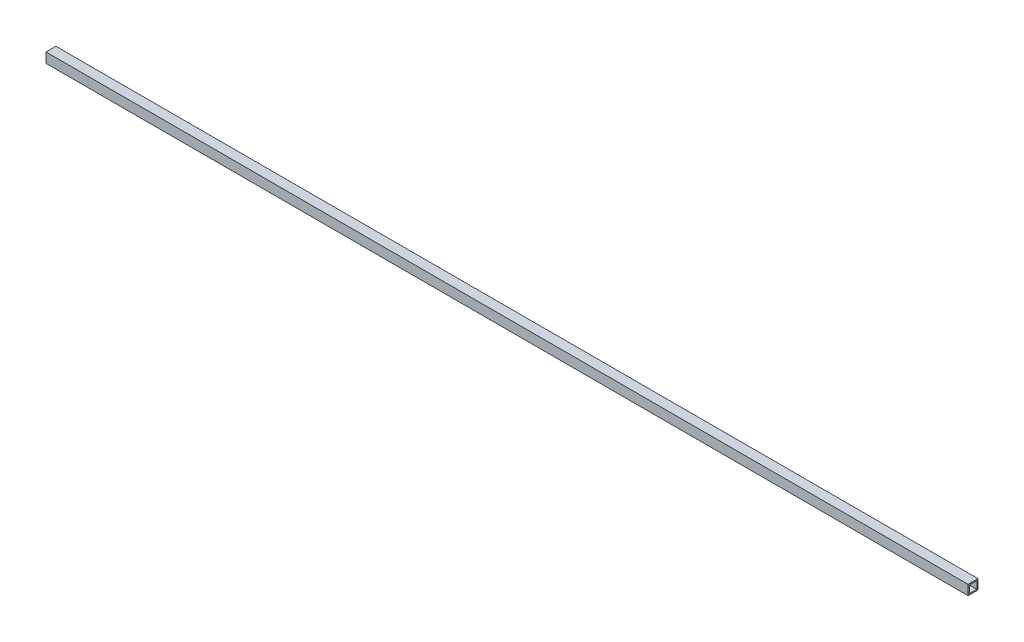
ISO-10303-21;
HEADER;
FILE_DESCRIPTION(('STEP AP214'),'2;1');
FILE_NAME('part.step','',(''),(''),'','','');
FILE_SCHEMA(('AUTOMOTIVE_DESIGN { 1 0 10303 214 1 1 1 1 }'));
ENDSEC;
DATA;
#1=APPLICATION_CONTEXT('core data for automotive mechanical design processes');
#2=APPLICATION_PROTOCOL_DEFINITION('international standard','automotive_design',2000,#1);
#3=PRODUCT_CONTEXT('',#1,'mechanical');
#4=PRODUCT('Part','Part','',(#3));
#5=PRODUCT_RELATED_PRODUCT_CATEGORY('part','',(#4));
#6=PRODUCT_DEFINITION_FORMATION('','',#4);
#7=PRODUCT_DEFINITION_CONTEXT('part definition',#1,'design');
#8=PRODUCT_DEFINITION('design','',#6,#7);
#9=PRODUCT_DEFINITION_SHAPE('','',#8);
#10=(LENGTH_UNIT() NAMED_UNIT(*) SI_UNIT(.MILLI.,.METRE.));
#11=(NAMED_UNIT(*) PLANE_ANGLE_UNIT() SI_UNIT($,.RADIAN.));
#12=(NAMED_UNIT(*) SI_UNIT($,.STERADIAN.) SOLID_ANGLE_UNIT());
#13=UNCERTAINTY_MEASURE_WITH_UNIT(LENGTH_MEASURE(1.E-05),#10,'distance_accuracy_value','');
#14=(GEOMETRIC_REPRESENTATION_CONTEXT(3) GLOBAL_UNCERTAINTY_ASSIGNED_CONTEXT((#13)) GLOBAL_UNIT_ASSIGNED_CONTEXT((#10,
#11,#12)) REPRESENTATION_CONTEXT('',''));
#15=CARTESIAN_POINT('',(0.,0.,0.));
#16=DIRECTION('',(0.,0.,1.));
#17=DIRECTION('',(1.,0.,0.));
#18=AXIS2_PLACEMENT_3D('',#15,#16,#17);
#19=CARTESIAN_POINT('',(4808.30704896854,25.4,-25.4));
#20=DIRECTION('',(0.,-1.,0.));
#21=DIRECTION('',(0.,0.,-1.));
#22=AXIS2_PLACEMENT_3D('',#19,#20,#21);
#23=PLANE('',#22);
#24=DIRECTION('',(0.,0.,1.));
#25=VECTOR('',#24,1.);
#26=CARTESIAN_POINT('',(4736.46499999999,25.4,-25.4));
#27=LINE('',#26,#25);
#28=CARTESIAN_POINT('',(4736.46499999999,25.4,-25.4));
#29=VERTEX_POINT('',#28);
#30=CARTESIAN_POINT('',(4736.46499999999,25.4,25.4));
#31=VERTEX_POINT('',#30);
#32=EDGE_CURVE('E164',#29,#31,#27,.T.);
#33=ORIENTED_EDGE('',*,*,#32,.F.);
#34=DIRECTION('',(-1.,0.,0.));
#35=VECTOR('',#34,1.);
#36=CARTESIAN_POINT('',(4808.30704896854,25.4,-25.4));
#37=LINE('',#36,#35);
#38=CARTESIAN_POINT('',(0.,25.4,-25.4));
#39=VERTEX_POINT('',#38);
#40=EDGE_CURVE('E55',#29,#39,#37,.T.);
#41=ORIENTED_EDGE('',*,*,#40,.T.);
#42=DIRECTION('',(0.,0.,1.));
#43=VECTOR('',#42,1.);
#44=CARTESIAN_POINT('',(0.,25.4,-25.4));
#45=LINE('',#44,#43);
#46=CARTESIAN_POINT('',(0.,25.4,25.4));
#47=VERTEX_POINT('',#46);
#48=EDGE_CURVE('E138',#39,#47,#45,.T.);
#49=ORIENTED_EDGE('',*,*,#48,.T.);
#50=DIRECTION('',(-1.,0.,0.));
#51=VECTOR('',#50,1.);
#52=CARTESIAN_POINT('',(4808.30704896854,25.4,25.4));
#53=LINE('',#52,#51);
#54=EDGE_CURVE('E141',#31,#47,#53,.T.);
#55=ORIENTED_EDGE('',*,*,#54,.F.);
#56=EDGE_LOOP('',(#33,#41,#49,#55));
#57=FACE_BOUND('',#56,.T.);
#58=ADVANCED_FACE('F40',(#57),#23,.F.);
#59=CARTESIAN_POINT('',(4808.30704896854,25.4,-25.4));
#60=DIRECTION('',(0.,0.,1.));
#61=DIRECTION('',(0.,-1.,0.));
#62=AXIS2_PLACEMENT_3D('',#59,#60,#61);
#63=PLANE('',#62);
#64=DIRECTION('',(0.,1.,0.));
#65=VECTOR('',#64,1.);
#66=CARTESIAN_POINT('',(4736.46499999999,25.4,-25.4));
#67=LINE('',#66,#65);
#68=CARTESIAN_POINT('',(4736.46499999999,-25.4,-25.4));
#69=VERTEX_POINT('',#68);
#70=EDGE_CURVE('E167',#69,#29,#67,.T.);
#71=ORIENTED_EDGE('',*,*,#70,.F.);
#72=DIRECTION('',(-1.,0.,0.));
#73=VECTOR('',#72,1.);
#74=CARTESIAN_POINT('',(4808.30704896854,-25.4,-25.4));
#75=LINE('',#74,#73);
#76=CARTESIAN_POINT('',(0.,-25.4,-25.4));
#77=VERTEX_POINT('',#76);
#78=EDGE_CURVE('E144',#69,#77,#75,.T.);
#79=ORIENTED_EDGE('',*,*,#78,.T.);
#80=DIRECTION('',(0.,1.,0.));
#81=VECTOR('',#80,1.);
#82=CARTESIAN_POINT('',(0.,25.4,-25.4));
#83=LINE('',#82,#81);
#84=EDGE_CURVE('E136',#77,#39,#83,.T.);
#85=ORIENTED_EDGE('',*,*,#84,.T.);
#86=ORIENTED_EDGE('',*,*,#40,.F.);
#87=EDGE_LOOP('',(#71,#79,#85,#86));
#88=FACE_BOUND('',#87,.T.);
#89=ADVANCED_FACE('F166',(#88),#63,.F.);
#90=CARTESIAN_POINT('',(4808.30704896854,-25.4,-25.4));
#91=DIRECTION('',(0.,1.,0.));
#92=DIRECTION('',(0.,0.,1.));
#93=AXIS2_PLACEMENT_3D('',#90,#91,#92);
#94=PLANE('',#93);
#95=DIRECTION('',(0.,0.,-1.));
#96=VECTOR('',#95,1.);
#97=CARTESIAN_POINT('',(4736.46499999999,-25.4,-25.4));
#98=LINE('',#97,#96);
#99=CARTESIAN_POINT('',(4736.46499999999,-25.4,25.4));
#100=VERTEX_POINT('',#99);
#101=EDGE_CURVE('E152',#100,#69,#98,.T.);
#102=ORIENTED_EDGE('',*,*,#101,.F.);
#103=DIRECTION('',(-1.,0.,0.));
#104=VECTOR('',#103,1.);
#105=CARTESIAN_POINT('',(4808.30704896854,-25.4,25.4));
#106=LINE('',#105,#104);
#107=CARTESIAN_POINT('',(0.,-25.4,25.4));
#108=VERTEX_POINT('',#107);
#109=EDGE_CURVE('E48',#100,#108,#106,.T.);
#110=ORIENTED_EDGE('',*,*,#109,.T.);
#111=DIRECTION('',(0.,0.,-1.));
#112=VECTOR('',#111,1.);
#113=CARTESIAN_POINT('',(0.,-25.4,-25.4));
#114=LINE('',#113,#112);
#115=EDGE_CURVE('E133',#108,#77,#114,.T.);
#116=ORIENTED_EDGE('',*,*,#115,.T.);
#117=ORIENTED_EDGE('',*,*,#78,.F.);
#118=EDGE_LOOP('',(#102,#110,#116,#117));
#119=FACE_BOUND('',#118,.T.);
#120=ADVANCED_FACE('F148',(#119),#94,.F.);
#121=CARTESIAN_POINT('',(4808.30704896854,25.4,25.4));
#122=DIRECTION('',(0.,0.,-1.));
#123=DIRECTION('',(-1.,0.,0.));
#124=AXIS2_PLACEMENT_3D('',#121,#122,#123);
#125=PLANE('',#124);
#126=DIRECTION('',(0.,-1.,0.));
#127=VECTOR('',#126,1.);
#128=CARTESIAN_POINT('',(4736.46499999999,25.4,25.4));
#129=LINE('',#128,#127);
#130=EDGE_CURVE('E161',#31,#100,#129,.T.);
#131=ORIENTED_EDGE('',*,*,#130,.F.);
#132=ORIENTED_EDGE('',*,*,#54,.T.);
#133=DIRECTION('',(0.,-1.,0.));
#134=VECTOR('',#133,1.);
#135=CARTESIAN_POINT('',(0.,25.4,25.4));
#136=LINE('',#135,#134);
#137=EDGE_CURVE('E130',#47,#108,#136,.T.);
#138=ORIENTED_EDGE('',*,*,#137,.T.);
#139=ORIENTED_EDGE('',*,*,#109,.F.);
#140=EDGE_LOOP('',(#131,#132,#138,#139));
#141=FACE_BOUND('',#140,.T.);
#142=ADVANCED_FACE('F42',(#141),#125,.F.);
#143=CARTESIAN_POINT('',(0.,0.,0.));
#144=DIRECTION('',(-1.,0.,0.));
#145=DIRECTION('',(0.,0.,1.));
#146=AXIS2_PLACEMENT_3D('',#143,#144,#145);
#147=PLANE('',#146);
#148=ORIENTED_EDGE('',*,*,#137,.F.);
#149=ORIENTED_EDGE('',*,*,#48,.F.);
#150=ORIENTED_EDGE('',*,*,#84,.F.);
#151=ORIENTED_EDGE('',*,*,#115,.F.);
#152=EDGE_LOOP('',(#148,#149,#150,#151));
#153=FACE_BOUND('',#152,.T.);
#154=DIRECTION('',(0.,1.,0.));
#155=VECTOR('',#154,1.);
#156=CARTESIAN_POINT('',(0.,19.05,-19.05));
#157=LINE('',#156,#155);
#158=CARTESIAN_POINT('',(0.,-19.05,-19.05));
#159=VERTEX_POINT('',#158);
#160=CARTESIAN_POINT('',(0.,19.05,-19.05));
#161=VERTEX_POINT('',#160);
#162=EDGE_CURVE('E120',#159,#161,#157,.T.);
#163=ORIENTED_EDGE('',*,*,#162,.T.);
#164=DIRECTION('',(0.,0.,1.));
#165=VECTOR('',#164,1.);
#166=CARTESIAN_POINT('',(0.,19.05,-19.05));
#167=LINE('',#166,#165);
#168=CARTESIAN_POINT('',(0.,19.05,19.05));
#169=VERTEX_POINT('',#168);
#170=EDGE_CURVE('E169',#161,#169,#167,.T.);
#171=ORIENTED_EDGE('',*,*,#170,.T.);
#172=DIRECTION('',(0.,-1.,0.));
#173=VECTOR('',#172,1.);
#174=CARTESIAN_POINT('',(0.,19.05,19.05));
#175=LINE('',#174,#173);
#176=CARTESIAN_POINT('',(0.,-19.05,19.05));
#177=VERTEX_POINT('',#176);
#178=EDGE_CURVE('E176',#169,#177,#175,.T.);
#179=ORIENTED_EDGE('',*,*,#178,.T.);
#180=DIRECTION('',(0.,0.,-1.));
#181=VECTOR('',#180,1.);
#182=CARTESIAN_POINT('',(0.,-19.05,-19.05));
#183=LINE('',#182,#181);
#184=EDGE_CURVE('E179',#177,#159,#183,.T.);
#185=ORIENTED_EDGE('',*,*,#184,.T.);
#186=EDGE_LOOP('',(#163,#171,#179,#185));
#187=FACE_BOUND('',#186,.T.);
#188=ADVANCED_FACE('F158',(#153,#187),#147,.T.);
#189=CARTESIAN_POINT('',(4808.30704896854,19.05,-19.05));
#190=DIRECTION('',(0.,0.,1.));
#191=DIRECTION('',(0.,-1.,0.));
#192=AXIS2_PLACEMENT_3D('',#189,#190,#191);
#193=PLANE('',#192);
#194=DIRECTION('',(-1.,0.,0.));
#195=VECTOR('',#194,1.);
#196=CARTESIAN_POINT('',(4808.30704896854,-19.05,-19.05));
#197=LINE('',#196,#195);
#198=CARTESIAN_POINT('',(4736.46499999999,-19.05,-19.05));
#199=VERTEX_POINT('',#198);
#200=EDGE_CURVE('E112',#199,#159,#197,.T.);
#201=ORIENTED_EDGE('',*,*,#200,.F.);
#202=DIRECTION('',(0.,1.,0.));
#203=VECTOR('',#202,1.);
#204=CARTESIAN_POINT('',(4736.46499999999,19.05,-19.05));
#205=LINE('',#204,#203);
#206=CARTESIAN_POINT('',(4736.46499999999,19.05,-19.05));
#207=VERTEX_POINT('',#206);
#208=EDGE_CURVE('E11',#199,#207,#205,.T.);
#209=ORIENTED_EDGE('',*,*,#208,.T.);
#210=DIRECTION('',(-1.,0.,0.));
#211=VECTOR('',#210,1.);
#212=CARTESIAN_POINT('',(4808.30704896854,19.05,-19.05));
#213=LINE('',#212,#211);
#214=EDGE_CURVE('E122',#207,#161,#213,.T.);
#215=ORIENTED_EDGE('',*,*,#214,.T.);
#216=ORIENTED_EDGE('',*,*,#162,.F.);
#217=EDGE_LOOP('',(#201,#209,#215,#216));
#218=FACE_BOUND('',#217,.T.);
#219=ADVANCED_FACE('F118',(#218),#193,.T.);
#220=CARTESIAN_POINT('',(4808.30704896854,-19.05,-19.05));
#221=DIRECTION('',(0.,1.,0.));
#222=DIRECTION('',(0.,0.,1.));
#223=AXIS2_PLACEMENT_3D('',#220,#221,#222);
#224=PLANE('',#223);
#225=DIRECTION('',(-1.,0.,0.));
#226=VECTOR('',#225,1.);
#227=CARTESIAN_POINT('',(4808.30704896854,-19.05,19.05));
#228=LINE('',#227,#226);
#229=CARTESIAN_POINT('',(4736.46499999999,-19.05,19.05));
#230=VERTEX_POINT('',#229);
#231=EDGE_CURVE('E114',#230,#177,#228,.T.);
#232=ORIENTED_EDGE('',*,*,#231,.F.);
#233=DIRECTION('',(0.,0.,-1.));
#234=VECTOR('',#233,1.);
#235=CARTESIAN_POINT('',(4736.46499999999,-19.05,-19.05));
#236=LINE('',#235,#234);
#237=EDGE_CURVE('E105',#230,#199,#236,.T.);
#238=ORIENTED_EDGE('',*,*,#237,.T.);
#239=ORIENTED_EDGE('',*,*,#200,.T.);
#240=ORIENTED_EDGE('',*,*,#184,.F.);
#241=EDGE_LOOP('',(#232,#238,#239,#240));
#242=FACE_BOUND('',#241,.T.);
#243=ADVANCED_FACE('F110',(#242),#224,.T.);
#244=CARTESIAN_POINT('',(4808.30704896854,19.05,19.05));
#245=DIRECTION('',(0.,0.,-1.));
#246=DIRECTION('',(0.,1.,0.));
#247=AXIS2_PLACEMENT_3D('',#244,#245,#246);
#248=PLANE('',#247);
#249=DIRECTION('',(-1.,0.,0.));
#250=VECTOR('',#249,1.);
#251=CARTESIAN_POINT('',(4808.30704896854,19.05,19.05));
#252=LINE('',#251,#250);
#253=CARTESIAN_POINT('',(4736.46499999999,19.05,19.05));
#254=VERTEX_POINT('',#253);
#255=EDGE_CURVE('E124',#254,#169,#252,.T.);
#256=ORIENTED_EDGE('',*,*,#255,.F.);
#257=DIRECTION('',(0.,-1.,0.));
#258=VECTOR('',#257,1.);
#259=CARTESIAN_POINT('',(4736.46499999999,19.05,19.05));
#260=LINE('',#259,#258);
#261=EDGE_CURVE('E116',#254,#230,#260,.T.);
#262=ORIENTED_EDGE('',*,*,#261,.T.);
#263=ORIENTED_EDGE('',*,*,#231,.T.);
#264=ORIENTED_EDGE('',*,*,#178,.F.);
#265=EDGE_LOOP('',(#256,#262,#263,#264));
#266=FACE_BOUND('',#265,.T.);
#267=ADVANCED_FACE('F184',(#266),#248,.T.);
#268=CARTESIAN_POINT('',(4808.30704896854,19.05,-19.05));
#269=DIRECTION('',(0.,-1.,0.));
#270=DIRECTION('',(0.,0.,-1.));
#271=AXIS2_PLACEMENT_3D('',#268,#269,#270);
#272=PLANE('',#271);
#273=ORIENTED_EDGE('',*,*,#214,.F.);
#274=DIRECTION('',(0.,0.,1.));
#275=VECTOR('',#274,1.);
#276=CARTESIAN_POINT('',(4736.46499999999,19.05,-19.05));
#277=LINE('',#276,#275);
#278=EDGE_CURVE('E63',#207,#254,#277,.T.);
#279=ORIENTED_EDGE('',*,*,#278,.T.);
#280=ORIENTED_EDGE('',*,*,#255,.T.);
#281=ORIENTED_EDGE('',*,*,#170,.F.);
#282=EDGE_LOOP('',(#273,#279,#280,#281));
#283=FACE_BOUND('',#282,.T.);
#284=ADVANCED_FACE('F188',(#283),#272,.T.);
#285=CARTESIAN_POINT('',(4736.46499999999,-31.75,-652.045130055595));
#286=DIRECTION('',(1.,0.,0.));
#287=DIRECTION('',(0.,0.,-1.));
#288=AXIS2_PLACEMENT_3D('',#285,#286,#287);
#289=PLANE('',#288);
#290=ORIENTED_EDGE('',*,*,#278,.F.);
#291=ORIENTED_EDGE('',*,*,#208,.F.);
#292=ORIENTED_EDGE('',*,*,#237,.F.);
#293=ORIENTED_EDGE('',*,*,#261,.F.);
#294=EDGE_LOOP('',(#290,#291,#292,#293));
#295=FACE_BOUND('',#294,.T.);
#296=ORIENTED_EDGE('',*,*,#32,.T.);
#297=ORIENTED_EDGE('',*,*,#130,.T.);
#298=ORIENTED_EDGE('',*,*,#101,.T.);
#299=ORIENTED_EDGE('',*,*,#70,.T.);
#300=EDGE_LOOP('',(#296,#297,#298,#299));
#301=FACE_BOUND('',#300,.T.);
#302=ADVANCED_FACE('F103',(#295,#301),#289,.T.);
#303=CLOSED_SHELL('',(#58,#89,#120,#142,#188,#219,#243,#267,#284,#302));
#304=MANIFOLD_SOLID_BREP('B2',#303);
#305=ADVANCED_BREP_SHAPE_REPRESENTATION('',(#18,#304),#14);
#306=SHAPE_DEFINITION_REPRESENTATION(#9,#305);
ENDSEC;
END-ISO-10303-21;
